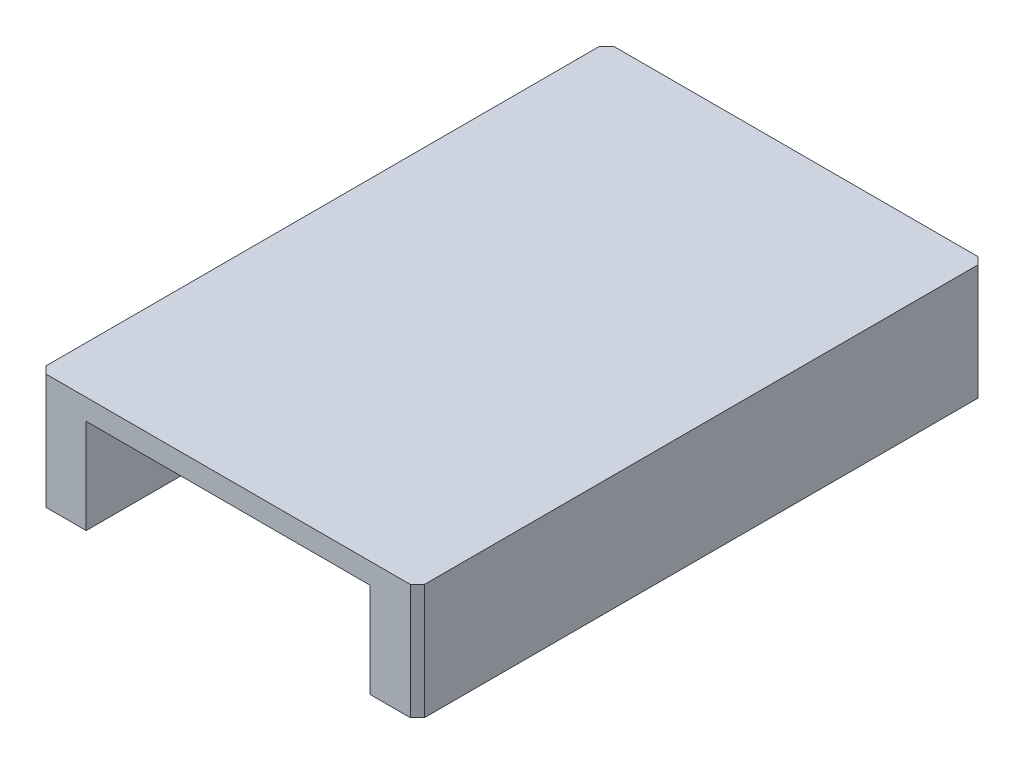
ISO-10303-21;
HEADER;
FILE_DESCRIPTION(('STEP AP214'),'2;1');
FILE_NAME('part.step','',(''),(''),'','','');
FILE_SCHEMA(('AUTOMOTIVE_DESIGN { 1 0 10303 214 1 1 1 1 }'));
ENDSEC;
DATA;
#1=APPLICATION_CONTEXT('core data for automotive mechanical design processes');
#2=APPLICATION_PROTOCOL_DEFINITION('international standard','automotive_design',2000,#1);
#3=PRODUCT_CONTEXT('',#1,'mechanical');
#4=PRODUCT('Part','Part','',(#3));
#5=PRODUCT_RELATED_PRODUCT_CATEGORY('part','',(#4));
#6=PRODUCT_DEFINITION_FORMATION('','',#4);
#7=PRODUCT_DEFINITION_CONTEXT('part definition',#1,'design');
#8=PRODUCT_DEFINITION('design','',#6,#7);
#9=PRODUCT_DEFINITION_SHAPE('','',#8);
#10=(LENGTH_UNIT() NAMED_UNIT(*) SI_UNIT(.MILLI.,.METRE.));
#11=(NAMED_UNIT(*) PLANE_ANGLE_UNIT() SI_UNIT($,.RADIAN.));
#12=(NAMED_UNIT(*) SI_UNIT($,.STERADIAN.) SOLID_ANGLE_UNIT());
#13=UNCERTAINTY_MEASURE_WITH_UNIT(LENGTH_MEASURE(1.E-05),#10,'distance_accuracy_value','');
#14=(GEOMETRIC_REPRESENTATION_CONTEXT(3) GLOBAL_UNCERTAINTY_ASSIGNED_CONTEXT((#13)) GLOBAL_UNIT_ASSIGNED_CONTEXT((#10,
#11,#12)) REPRESENTATION_CONTEXT('',''));
#15=CARTESIAN_POINT('',(0.,0.,0.));
#16=DIRECTION('',(0.,0.,1.));
#17=DIRECTION('',(1.,0.,0.));
#18=AXIS2_PLACEMENT_3D('',#15,#16,#17);
#19=CARTESIAN_POINT('',(40.,0.,0.));
#20=DIRECTION('',(-1.,0.,0.));
#21=DIRECTION('',(0.,0.,1.));
#22=AXIS2_PLACEMENT_3D('',#19,#20,#21);
#23=PLANE('',#22);
#24=DIRECTION('',(0.,-1.,0.));
#25=VECTOR('',#24,1.);
#26=CARTESIAN_POINT('',(40.,0.,-0.750000000000001));
#27=LINE('',#26,#25);
#28=CARTESIAN_POINT('',(40.,7.19999999999999,-0.750000000000001));
#29=VERTEX_POINT('',#28);
#30=CARTESIAN_POINT('',(40.,-5.,-0.750000000000001));
#31=VERTEX_POINT('',#30);
#32=EDGE_CURVE('E219',#29,#31,#27,.T.);
#33=ORIENTED_EDGE('',*,*,#32,.T.);
#34=DIRECTION('',(0.,0.,1.));
#35=VECTOR('',#34,1.);
#36=CARTESIAN_POINT('',(40.,-4.99999999999999,-59.25));
#37=LINE('',#36,#35);
#38=CARTESIAN_POINT('',(40.,-4.99999999999999,-59.25));
#39=VERTEX_POINT('',#38);
#40=EDGE_CURVE('E165',#39,#31,#37,.T.);
#41=ORIENTED_EDGE('',*,*,#40,.F.);
#42=DIRECTION('',(0.,1.,0.));
#43=VECTOR('',#42,1.);
#44=CARTESIAN_POINT('',(40.,0.,-59.25));
#45=LINE('',#44,#43);
#46=CARTESIAN_POINT('',(40.,7.19999999999999,-59.25));
#47=VERTEX_POINT('',#46);
#48=EDGE_CURVE('E221',#39,#47,#45,.T.);
#49=ORIENTED_EDGE('',*,*,#48,.T.);
#50=DIRECTION('',(0.,0.,1.));
#51=VECTOR('',#50,1.);
#52=CARTESIAN_POINT('',(40.,7.19999999999999,0.));
#53=LINE('',#52,#51);
#54=EDGE_CURVE('E199',#47,#29,#53,.T.);
#55=ORIENTED_EDGE('',*,*,#54,.T.);
#56=EDGE_LOOP('',(#33,#41,#49,#55));
#57=FACE_BOUND('',#56,.T.);
#58=ADVANCED_FACE('F43',(#57),#23,.F.);
#59=CARTESIAN_POINT('',(0.,0.,0.));
#60=DIRECTION('',(-1.,0.,0.));
#61=DIRECTION('',(0.,0.,1.));
#62=AXIS2_PLACEMENT_3D('',#59,#60,#61);
#63=PLANE('',#62);
#64=DIRECTION('',(0.,0.,1.));
#65=VECTOR('',#64,1.);
#66=CARTESIAN_POINT('',(0.,7.19999999999999,0.));
#67=LINE('',#66,#65);
#68=CARTESIAN_POINT('',(0.,7.19999999999999,-59.25));
#69=VERTEX_POINT('',#68);
#70=CARTESIAN_POINT('',(0.,7.19999999999999,-0.750000000000001));
#71=VERTEX_POINT('',#70);
#72=EDGE_CURVE('E198',#69,#71,#67,.T.);
#73=ORIENTED_EDGE('',*,*,#72,.F.);
#74=DIRECTION('',(0.,-1.,0.));
#75=VECTOR('',#74,1.);
#76=CARTESIAN_POINT('',(0.,0.,-59.25));
#77=LINE('',#76,#75);
#78=CARTESIAN_POINT('',(0.,-4.99999999999999,-59.25));
#79=VERTEX_POINT('',#78);
#80=EDGE_CURVE('E217',#69,#79,#77,.T.);
#81=ORIENTED_EDGE('',*,*,#80,.T.);
#82=DIRECTION('',(0.,0.,-1.));
#83=VECTOR('',#82,1.);
#84=CARTESIAN_POINT('',(0.,-5.,-0.750000000000001));
#85=LINE('',#84,#83);
#86=CARTESIAN_POINT('',(0.,-5.,-0.750000000000001));
#87=VERTEX_POINT('',#86);
#88=EDGE_CURVE('E177',#87,#79,#85,.T.);
#89=ORIENTED_EDGE('',*,*,#88,.F.);
#90=DIRECTION('',(0.,1.,0.));
#91=VECTOR('',#90,1.);
#92=CARTESIAN_POINT('',(0.,7.19999999999999,-0.750000000000002));
#93=LINE('',#92,#91);
#94=EDGE_CURVE('E215',#87,#71,#93,.T.);
#95=ORIENTED_EDGE('',*,*,#94,.T.);
#96=EDGE_LOOP('',(#73,#81,#89,#95));
#97=FACE_BOUND('',#96,.T.);
#98=ADVANCED_FACE('F238',(#97),#63,.T.);
#99=CARTESIAN_POINT('',(40.,7.19999999999999,-60.));
#100=DIRECTION('',(0.,0.,1.));
#101=DIRECTION('',(0.,-1.,0.));
#102=AXIS2_PLACEMENT_3D('',#99,#100,#101);
#103=PLANE('',#102);
#104=DIRECTION('',(0.,-1.,0.));
#105=VECTOR('',#104,1.);
#106=CARTESIAN_POINT('',(39.25,7.19999999999999,-60.));
#107=LINE('',#106,#105);
#108=CARTESIAN_POINT('',(39.25,7.19999999999999,-60.));
#109=VERTEX_POINT('',#108);
#110=CARTESIAN_POINT('',(39.25,-4.99999999999999,-60.));
#111=VERTEX_POINT('',#110);
#112=EDGE_CURVE('E206',#109,#111,#107,.T.);
#113=ORIENTED_EDGE('',*,*,#112,.T.);
#114=DIRECTION('',(1.,0.,0.));
#115=VECTOR('',#114,1.);
#116=CARTESIAN_POINT('',(35.,-4.99999999999999,-60.));
#117=LINE('',#116,#115);
#118=CARTESIAN_POINT('',(35.,-4.99999999999999,-60.));
#119=VERTEX_POINT('',#118);
#120=EDGE_CURVE('E152',#119,#111,#117,.T.);
#121=ORIENTED_EDGE('',*,*,#120,.F.);
#122=DIRECTION('',(0.,1.,0.));
#123=VECTOR('',#122,1.);
#124=CARTESIAN_POINT('',(35.,0.,-60.));
#125=LINE('',#124,#123);
#126=CARTESIAN_POINT('',(35.,4.99999999999999,-60.));
#127=VERTEX_POINT('',#126);
#128=EDGE_CURVE('E148',#119,#127,#125,.T.);
#129=ORIENTED_EDGE('',*,*,#128,.T.);
#130=DIRECTION('',(-1.,0.,0.));
#131=VECTOR('',#130,1.);
#132=CARTESIAN_POINT('',(35.,4.99999999999999,-60.));
#133=LINE('',#132,#131);
#134=CARTESIAN_POINT('',(5.,4.99999999999999,-60.));
#135=VERTEX_POINT('',#134);
#136=EDGE_CURVE('E142',#127,#135,#133,.T.);
#137=ORIENTED_EDGE('',*,*,#136,.T.);
#138=DIRECTION('',(0.,-1.,0.));
#139=VECTOR('',#138,1.);
#140=CARTESIAN_POINT('',(5.,0.,-60.));
#141=LINE('',#140,#139);
#142=CARTESIAN_POINT('',(5.,-4.99999999999999,-60.));
#143=VERTEX_POINT('',#142);
#144=EDGE_CURVE('E193',#135,#143,#141,.T.);
#145=ORIENTED_EDGE('',*,*,#144,.T.);
#146=DIRECTION('',(1.,0.,0.));
#147=VECTOR('',#146,1.);
#148=CARTESIAN_POINT('',(0.750000000000008,-4.99999999999999,-60.));
#149=LINE('',#148,#147);
#150=CARTESIAN_POINT('',(0.750000000000008,-4.99999999999999,-60.));
#151=VERTEX_POINT('',#150);
#152=EDGE_CURVE('E183',#151,#143,#149,.T.);
#153=ORIENTED_EDGE('',*,*,#152,.F.);
#154=DIRECTION('',(0.,1.,0.));
#155=VECTOR('',#154,1.);
#156=CARTESIAN_POINT('',(0.750000000000008,7.19999999999999,-60.));
#157=LINE('',#156,#155);
#158=CARTESIAN_POINT('',(0.750000000000008,7.19999999999999,-60.));
#159=VERTEX_POINT('',#158);
#160=EDGE_CURVE('E208',#151,#159,#157,.T.);
#161=ORIENTED_EDGE('',*,*,#160,.T.);
#162=DIRECTION('',(-1.,0.,0.));
#163=VECTOR('',#162,1.);
#164=CARTESIAN_POINT('',(40.,7.19999999999999,-60.));
#165=LINE('',#164,#163);
#166=EDGE_CURVE('E204',#109,#159,#165,.T.);
#167=ORIENTED_EDGE('',*,*,#166,.F.);
#168=EDGE_LOOP('',(#113,#121,#129,#137,#145,#153,#161,#167));
#169=FACE_BOUND('',#168,.T.);
#170=ADVANCED_FACE('F247',(#169),#103,.F.);
#171=CARTESIAN_POINT('',(40.,7.19999999999999,0.));
#172=DIRECTION('',(0.,-1.,0.));
#173=DIRECTION('',(0.,0.,-1.));
#174=AXIS2_PLACEMENT_3D('',#171,#172,#173);
#175=PLANE('',#174);
#176=DIRECTION('',(0.707106781186548,0.,0.707106781186548));
#177=VECTOR('',#176,1.);
#178=CARTESIAN_POINT('',(0.750000000000002,7.19999999999999,0.));
#179=LINE('',#178,#177);
#180=CARTESIAN_POINT('',(0.750000000000001,7.19999999999999,0.));
#181=VERTEX_POINT('',#180);
#182=EDGE_CURVE('E211',#71,#181,#179,.T.);
#183=ORIENTED_EDGE('',*,*,#182,.T.);
#184=DIRECTION('',(-1.,0.,0.));
#185=VECTOR('',#184,1.);
#186=CARTESIAN_POINT('',(40.,7.19999999999999,0.));
#187=LINE('',#186,#185);
#188=CARTESIAN_POINT('',(39.25,7.19999999999999,0.));
#189=VERTEX_POINT('',#188);
#190=EDGE_CURVE('E59',#189,#181,#187,.T.);
#191=ORIENTED_EDGE('',*,*,#190,.F.);
#192=DIRECTION('',(-0.707106781186548,0.,0.707106781186548));
#193=VECTOR('',#192,1.);
#194=CARTESIAN_POINT('',(40.,7.19999999999999,-0.750000000000001));
#195=LINE('',#194,#193);
#196=EDGE_CURVE('E63',#189,#29,#195,.F.);
#197=ORIENTED_EDGE('',*,*,#196,.T.);
#198=ORIENTED_EDGE('',*,*,#54,.F.);
#199=DIRECTION('',(0.707106781186544,0.,0.707106781186551));
#200=VECTOR('',#199,1.);
#201=CARTESIAN_POINT('',(40.,7.19999999999999,-59.25));
#202=LINE('',#201,#200);
#203=EDGE_CURVE('E225',#47,#109,#202,.F.);
#204=ORIENTED_EDGE('',*,*,#203,.T.);
#205=ORIENTED_EDGE('',*,*,#166,.T.);
#206=DIRECTION('',(-0.707106781186548,0.,0.707106781186548));
#207=VECTOR('',#206,1.);
#208=CARTESIAN_POINT('',(0.750000000000008,7.19999999999999,-60.));
#209=LINE('',#208,#207);
#210=EDGE_CURVE('E213',#159,#69,#209,.T.);
#211=ORIENTED_EDGE('',*,*,#210,.T.);
#212=ORIENTED_EDGE('',*,*,#72,.T.);
#213=EDGE_LOOP('',(#183,#191,#197,#198,#204,#205,#211,#212));
#214=FACE_BOUND('',#213,.T.);
#215=ADVANCED_FACE('F240',(#214),#175,.F.);
#216=CARTESIAN_POINT('',(40.,0.,0.));
#217=DIRECTION('',(0.,0.,-1.));
#218=DIRECTION('',(0.,1.,0.));
#219=AXIS2_PLACEMENT_3D('',#216,#217,#218);
#220=PLANE('',#219);
#221=DIRECTION('',(0.,-1.,0.));
#222=VECTOR('',#221,1.);
#223=CARTESIAN_POINT('',(0.750000000000001,0.,0.));
#224=LINE('',#223,#222);
#225=CARTESIAN_POINT('',(0.750000000000001,-5.,0.));
#226=VERTEX_POINT('',#225);
#227=EDGE_CURVE('E52',#181,#226,#224,.T.);
#228=ORIENTED_EDGE('',*,*,#227,.T.);
#229=DIRECTION('',(-1.,0.,0.));
#230=VECTOR('',#229,1.);
#231=CARTESIAN_POINT('',(5.,-5.,0.));
#232=LINE('',#231,#230);
#233=CARTESIAN_POINT('',(5.,-5.,0.));
#234=VERTEX_POINT('',#233);
#235=EDGE_CURVE('E171',#234,#226,#232,.T.);
#236=ORIENTED_EDGE('',*,*,#235,.F.);
#237=DIRECTION('',(0.,-1.,0.));
#238=VECTOR('',#237,1.);
#239=CARTESIAN_POINT('',(5.,0.,0.));
#240=LINE('',#239,#238);
#241=CARTESIAN_POINT('',(5.,4.99999999999999,0.));
#242=VERTEX_POINT('',#241);
#243=EDGE_CURVE('E192',#242,#234,#240,.T.);
#244=ORIENTED_EDGE('',*,*,#243,.F.);
#245=DIRECTION('',(-1.,0.,0.));
#246=VECTOR('',#245,1.);
#247=CARTESIAN_POINT('',(35.,4.99999999999999,0.));
#248=LINE('',#247,#246);
#249=CARTESIAN_POINT('',(35.,4.99999999999999,0.));
#250=VERTEX_POINT('',#249);
#251=EDGE_CURVE('E140',#250,#242,#248,.T.);
#252=ORIENTED_EDGE('',*,*,#251,.F.);
#253=DIRECTION('',(0.,1.,0.));
#254=VECTOR('',#253,1.);
#255=CARTESIAN_POINT('',(35.,0.,0.));
#256=LINE('',#255,#254);
#257=CARTESIAN_POINT('',(35.,-5.,0.));
#258=VERTEX_POINT('',#257);
#259=EDGE_CURVE('E133',#258,#250,#256,.T.);
#260=ORIENTED_EDGE('',*,*,#259,.F.);
#261=DIRECTION('',(-1.,0.,0.));
#262=VECTOR('',#261,1.);
#263=CARTESIAN_POINT('',(39.25,-5.,0.));
#264=LINE('',#263,#262);
#265=CARTESIAN_POINT('',(39.25,-5.,0.));
#266=VERTEX_POINT('',#265);
#267=EDGE_CURVE('E137',#266,#258,#264,.T.);
#268=ORIENTED_EDGE('',*,*,#267,.F.);
#269=DIRECTION('',(0.,1.,0.));
#270=VECTOR('',#269,1.);
#271=CARTESIAN_POINT('',(39.25,0.,0.));
#272=LINE('',#271,#270);
#273=EDGE_CURVE('E11',#266,#189,#272,.T.);
#274=ORIENTED_EDGE('',*,*,#273,.T.);
#275=ORIENTED_EDGE('',*,*,#190,.T.);
#276=EDGE_LOOP('',(#228,#236,#244,#252,#260,#268,#274,#275));
#277=FACE_BOUND('',#276,.T.);
#278=ADVANCED_FACE('F135',(#277),#220,.F.);
#279=CARTESIAN_POINT('',(5.,0.,-60.));
#280=DIRECTION('',(-1.,0.,0.));
#281=DIRECTION('',(0.,0.,1.));
#282=AXIS2_PLACEMENT_3D('',#279,#280,#281);
#283=PLANE('',#282);
#284=ORIENTED_EDGE('',*,*,#144,.F.);
#285=DIRECTION('',(0.,0.,1.));
#286=VECTOR('',#285,1.);
#287=CARTESIAN_POINT('',(5.,4.99999999999999,-60.));
#288=LINE('',#287,#286);
#289=EDGE_CURVE('E195',#135,#242,#288,.T.);
#290=ORIENTED_EDGE('',*,*,#289,.T.);
#291=ORIENTED_EDGE('',*,*,#243,.T.);
#292=DIRECTION('',(0.,0.,1.));
#293=VECTOR('',#292,1.);
#294=CARTESIAN_POINT('',(5.,-4.99999999999999,-60.));
#295=LINE('',#294,#293);
#296=EDGE_CURVE('E168',#143,#234,#295,.T.);
#297=ORIENTED_EDGE('',*,*,#296,.F.);
#298=EDGE_LOOP('',(#284,#290,#291,#297));
#299=FACE_BOUND('',#298,.T.);
#300=ADVANCED_FACE('F251',(#299),#283,.F.);
#301=CARTESIAN_POINT('',(35.,4.99999999999999,-60.));
#302=DIRECTION('',(0.,1.,0.));
#303=DIRECTION('',(-1.,0.,0.));
#304=AXIS2_PLACEMENT_3D('',#301,#302,#303);
#305=PLANE('',#304);
#306=ORIENTED_EDGE('',*,*,#251,.T.);
#307=ORIENTED_EDGE('',*,*,#289,.F.);
#308=ORIENTED_EDGE('',*,*,#136,.F.);
#309=DIRECTION('',(0.,0.,1.));
#310=VECTOR('',#309,1.);
#311=CARTESIAN_POINT('',(35.,4.99999999999999,-60.));
#312=LINE('',#311,#310);
#313=EDGE_CURVE('E189',#127,#250,#312,.T.);
#314=ORIENTED_EDGE('',*,*,#313,.T.);
#315=EDGE_LOOP('',(#306,#307,#308,#314));
#316=FACE_BOUND('',#315,.T.);
#317=ADVANCED_FACE('F253',(#316),#305,.F.);
#318=CARTESIAN_POINT('',(35.,0.,-60.));
#319=DIRECTION('',(1.,0.,0.));
#320=DIRECTION('',(0.,1.,0.));
#321=AXIS2_PLACEMENT_3D('',#318,#319,#320);
#322=PLANE('',#321);
#323=ORIENTED_EDGE('',*,*,#313,.F.);
#324=ORIENTED_EDGE('',*,*,#128,.F.);
#325=DIRECTION('',(0.,0.,-1.));
#326=VECTOR('',#325,1.);
#327=CARTESIAN_POINT('',(35.,-5.,0.));
#328=LINE('',#327,#326);
#329=EDGE_CURVE('E145',#258,#119,#328,.T.);
#330=ORIENTED_EDGE('',*,*,#329,.F.);
#331=ORIENTED_EDGE('',*,*,#259,.T.);
#332=EDGE_LOOP('',(#323,#324,#330,#331));
#333=FACE_BOUND('',#332,.T.);
#334=ADVANCED_FACE('F146',(#333),#322,.F.);
#335=CARTESIAN_POINT('',(0.750000000000008,7.19999999999999,-60.));
#336=DIRECTION('',(-0.707106781186547,0.,-0.707106781186547));
#337=DIRECTION('',(0.,-1.,0.));
#338=AXIS2_PLACEMENT_3D('',#335,#336,#337);
#339=PLANE('',#338);
#340=ORIENTED_EDGE('',*,*,#160,.F.);
#341=DIRECTION('',(0.707106781186547,0.,-0.707106781186547));
#342=VECTOR('',#341,1.);
#343=CARTESIAN_POINT('',(0.,-4.99999999999999,-59.25));
#344=LINE('',#343,#342);
#345=EDGE_CURVE('E180',#79,#151,#344,.T.);
#346=ORIENTED_EDGE('',*,*,#345,.F.);
#347=ORIENTED_EDGE('',*,*,#80,.F.);
#348=ORIENTED_EDGE('',*,*,#210,.F.);
#349=EDGE_LOOP('',(#340,#346,#347,#348));
#350=FACE_BOUND('',#349,.T.);
#351=ADVANCED_FACE('F243',(#350),#339,.T.);
#352=CARTESIAN_POINT('',(40.,0.,-59.25));
#353=DIRECTION('',(-0.707106781186551,0.,0.707106781186544));
#354=DIRECTION('',(0.,1.,0.));
#355=AXIS2_PLACEMENT_3D('',#352,#353,#354);
#356=PLANE('',#355);
#357=ORIENTED_EDGE('',*,*,#48,.F.);
#358=DIRECTION('',(0.707106781186544,0.,0.707106781186551));
#359=VECTOR('',#358,1.);
#360=CARTESIAN_POINT('',(39.25,-4.99999999999999,-60.));
#361=LINE('',#360,#359);
#362=EDGE_CURVE('E162',#111,#39,#361,.T.);
#363=ORIENTED_EDGE('',*,*,#362,.F.);
#364=ORIENTED_EDGE('',*,*,#112,.F.);
#365=ORIENTED_EDGE('',*,*,#203,.F.);
#366=EDGE_LOOP('',(#357,#363,#364,#365));
#367=FACE_BOUND('',#366,.T.);
#368=ADVANCED_FACE('F258',(#367),#356,.F.);
#369=CARTESIAN_POINT('',(40.,0.,-0.750000000000001));
#370=DIRECTION('',(-0.707106781186547,0.,-0.707106781186547));
#371=DIRECTION('',(0.,-1.,0.));
#372=AXIS2_PLACEMENT_3D('',#369,#370,#371);
#373=PLANE('',#372);
#374=ORIENTED_EDGE('',*,*,#196,.F.);
#375=ORIENTED_EDGE('',*,*,#273,.F.);
#376=DIRECTION('',(-0.707106781186547,0.,0.707106781186547));
#377=VECTOR('',#376,1.);
#378=CARTESIAN_POINT('',(40.,-5.,-0.750000000000001));
#379=LINE('',#378,#377);
#380=EDGE_CURVE('E158',#31,#266,#379,.T.);
#381=ORIENTED_EDGE('',*,*,#380,.F.);
#382=ORIENTED_EDGE('',*,*,#32,.F.);
#383=EDGE_LOOP('',(#374,#375,#381,#382));
#384=FACE_BOUND('',#383,.T.);
#385=ADVANCED_FACE('F262',(#384),#373,.F.);
#386=CARTESIAN_POINT('',(0.750000000000001,0.,0.));
#387=DIRECTION('',(-0.707106781186547,0.,0.707106781186547));
#388=DIRECTION('',(0.,1.,0.));
#389=AXIS2_PLACEMENT_3D('',#386,#387,#388);
#390=PLANE('',#389);
#391=ORIENTED_EDGE('',*,*,#182,.F.);
#392=ORIENTED_EDGE('',*,*,#94,.F.);
#393=DIRECTION('',(-0.707106781186547,0.,-0.707106781186547));
#394=VECTOR('',#393,1.);
#395=CARTESIAN_POINT('',(0.750000000000001,-5.,0.));
#396=LINE('',#395,#394);
#397=EDGE_CURVE('E174',#226,#87,#396,.T.);
#398=ORIENTED_EDGE('',*,*,#397,.F.);
#399=ORIENTED_EDGE('',*,*,#227,.F.);
#400=EDGE_LOOP('',(#391,#392,#398,#399));
#401=FACE_BOUND('',#400,.T.);
#402=ADVANCED_FACE('F46',(#401),#390,.T.);
#403=CARTESIAN_POINT('',(0.,-5.,0.));
#404=DIRECTION('',(0.,-1.,0.));
#405=DIRECTION('',(0.,0.,-1.));
#406=AXIS2_PLACEMENT_3D('',#403,#404,#405);
#407=PLANE('',#406);
#408=ORIENTED_EDGE('',*,*,#296,.T.);
#409=ORIENTED_EDGE('',*,*,#235,.T.);
#410=ORIENTED_EDGE('',*,*,#397,.T.);
#411=ORIENTED_EDGE('',*,*,#88,.T.);
#412=ORIENTED_EDGE('',*,*,#345,.T.);
#413=ORIENTED_EDGE('',*,*,#152,.T.);
#414=EDGE_LOOP('',(#408,#409,#410,#411,#412,#413));
#415=FACE_BOUND('',#414,.T.);
#416=ADVANCED_FACE('F233',(#415),#407,.T.);
#417=CARTESIAN_POINT('',(0.,-5.,0.));
#418=DIRECTION('',(0.,-1.,0.));
#419=DIRECTION('',(0.,0.,-1.));
#420=AXIS2_PLACEMENT_3D('',#417,#418,#419);
#421=PLANE('',#420);
#422=ORIENTED_EDGE('',*,*,#267,.T.);
#423=ORIENTED_EDGE('',*,*,#329,.T.);
#424=ORIENTED_EDGE('',*,*,#120,.T.);
#425=ORIENTED_EDGE('',*,*,#362,.T.);
#426=ORIENTED_EDGE('',*,*,#40,.T.);
#427=ORIENTED_EDGE('',*,*,#380,.T.);
#428=EDGE_LOOP('',(#422,#423,#424,#425,#426,#427));
#429=FACE_BOUND('',#428,.T.);
#430=ADVANCED_FACE('F155',(#429),#421,.T.);
#431=CLOSED_SHELL('',(#58,#98,#170,#215,#278,#300,#317,#334,#351,#368,#385,#402,#416,#430));
#432=MANIFOLD_SOLID_BREP('B2',#431);
#433=ADVANCED_BREP_SHAPE_REPRESENTATION('',(#18,#432),#14);
#434=SHAPE_DEFINITION_REPRESENTATION(#9,#433);
ENDSEC;
END-ISO-10303-21;
